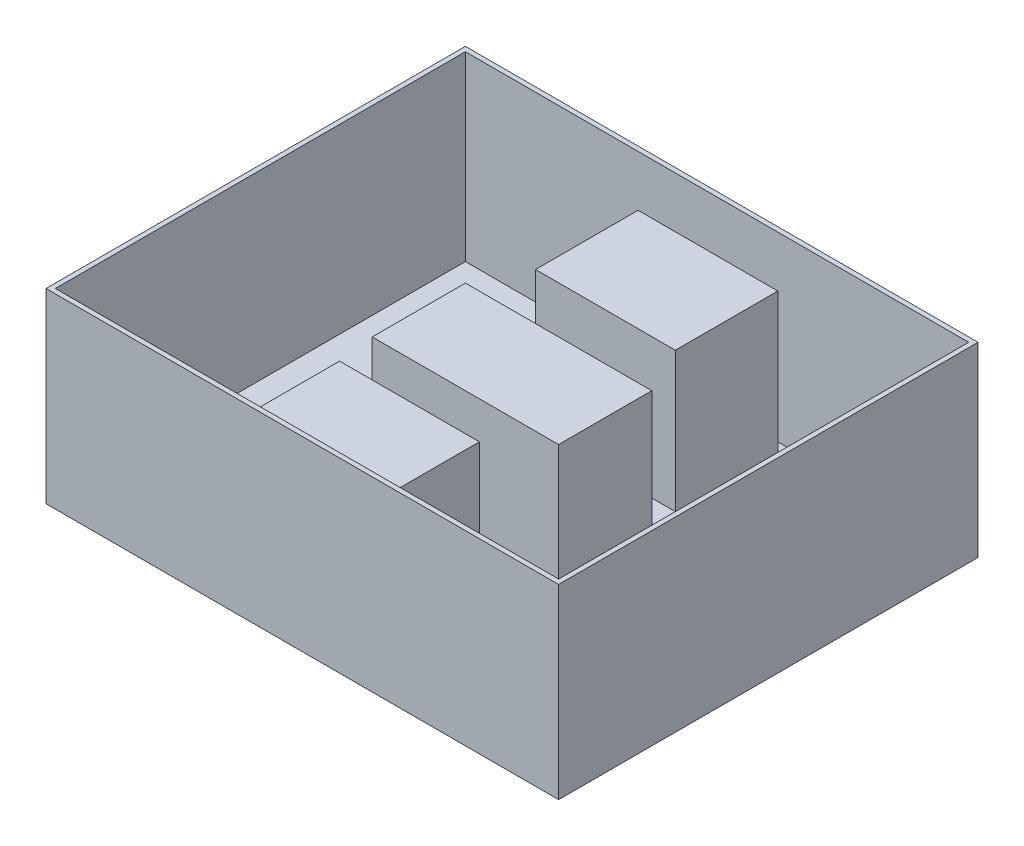
ISO-10303-21;
HEADER;
FILE_DESCRIPTION(('STEP AP214'),'2;1');
FILE_NAME('part.step','',(''),(''),'','','');
FILE_SCHEMA(('AUTOMOTIVE_DESIGN { 1 0 10303 214 1 1 1 1 }'));
ENDSEC;
DATA;
#1=APPLICATION_CONTEXT('core data for automotive mechanical design processes');
#2=APPLICATION_PROTOCOL_DEFINITION('international standard','automotive_design',2000,#1);
#3=PRODUCT_CONTEXT('',#1,'mechanical');
#4=PRODUCT('Part','Part','',(#3));
#5=PRODUCT_RELATED_PRODUCT_CATEGORY('part','',(#4));
#6=PRODUCT_DEFINITION_FORMATION('','',#4);
#7=PRODUCT_DEFINITION_CONTEXT('part definition',#1,'design');
#8=PRODUCT_DEFINITION('design','',#6,#7);
#9=PRODUCT_DEFINITION_SHAPE('','',#8);
#10=(LENGTH_UNIT() NAMED_UNIT(*) SI_UNIT(.MILLI.,.METRE.));
#11=(NAMED_UNIT(*) PLANE_ANGLE_UNIT() SI_UNIT($,.RADIAN.));
#12=(NAMED_UNIT(*) SI_UNIT($,.STERADIAN.) SOLID_ANGLE_UNIT());
#13=UNCERTAINTY_MEASURE_WITH_UNIT(LENGTH_MEASURE(1.E-05),#10,'distance_accuracy_value','');
#14=(GEOMETRIC_REPRESENTATION_CONTEXT(3) GLOBAL_UNCERTAINTY_ASSIGNED_CONTEXT((#13)) GLOBAL_UNIT_ASSIGNED_CONTEXT((#10,
#11,#12)) REPRESENTATION_CONTEXT('',''));
#15=CARTESIAN_POINT('',(0.,0.,0.));
#16=DIRECTION('',(0.,0.,1.));
#17=DIRECTION('',(1.,0.,0.));
#18=AXIS2_PLACEMENT_3D('',#15,#16,#17);
#19=CARTESIAN_POINT('',(0.,5.,0.));
#20=DIRECTION('',(0.,-1.,0.));
#21=DIRECTION('',(0.,0.,-1.));
#22=AXIS2_PLACEMENT_3D('',#19,#20,#21);
#23=PLANE('',#22);
#24=DIRECTION('',(0.,0.,1.));
#25=VECTOR('',#24,1.);
#26=CARTESIAN_POINT('',(75.,5.,-210.273399608635));
#27=LINE('',#26,#25);
#28=CARTESIAN_POINT('',(75.,5.,-210.273399608635));
#29=VERTEX_POINT('',#28);
#30=CARTESIAN_POINT('',(75.,5.,-100.273399608635));
#31=VERTEX_POINT('',#30);
#32=EDGE_CURVE('E197',#29,#31,#27,.T.);
#33=ORIENTED_EDGE('',*,*,#32,.T.);
#34=DIRECTION('',(-1.,0.,0.));
#35=VECTOR('',#34,1.);
#36=CARTESIAN_POINT('',(75.,5.,-100.273399608635));
#37=LINE('',#36,#35);
#38=CARTESIAN_POINT('',(-75.,5.,-100.273399608635));
#39=VERTEX_POINT('',#38);
#40=EDGE_CURVE('E204',#31,#39,#37,.T.);
#41=ORIENTED_EDGE('',*,*,#40,.T.);
#42=DIRECTION('',(0.,0.,-1.));
#43=VECTOR('',#42,1.);
#44=CARTESIAN_POINT('',(-75.,5.,-100.273399608635));
#45=LINE('',#44,#43);
#46=CARTESIAN_POINT('',(-75.,5.,-210.273399608635));
#47=VERTEX_POINT('',#46);
#48=EDGE_CURVE('E177',#39,#47,#45,.T.);
#49=ORIENTED_EDGE('',*,*,#48,.T.);
#50=DIRECTION('',(1.,0.,0.));
#51=VECTOR('',#50,1.);
#52=CARTESIAN_POINT('',(-75.,5.,-210.273399608635));
#53=LINE('',#52,#51);
#54=EDGE_CURVE('E50',#47,#29,#53,.T.);
#55=ORIENTED_EDGE('',*,*,#54,.T.);
#56=EDGE_LOOP('',(#33,#41,#49,#55));
#57=FACE_BOUND('',#56,.T.);
#58=DIRECTION('',(1.,0.,0.));
#59=VECTOR('',#58,1.);
#60=CARTESIAN_POINT('',(75.,5.,213.232553667431));
#61=LINE('',#60,#59);
#62=CARTESIAN_POINT('',(-75.,5.,213.232553667431));
#63=VERTEX_POINT('',#62);
#64=CARTESIAN_POINT('',(75.,5.,213.232553667431));
#65=VERTEX_POINT('',#64);
#66=EDGE_CURVE('E225',#63,#65,#61,.T.);
#67=ORIENTED_EDGE('',*,*,#66,.F.);
#68=DIRECTION('',(0.,0.,1.));
#69=VECTOR('',#68,1.);
#70=CARTESIAN_POINT('',(-75.,5.,213.232553667431));
#71=LINE('',#70,#69);
#72=CARTESIAN_POINT('',(-75.,5.,110.));
#73=VERTEX_POINT('',#72);
#74=EDGE_CURVE('E58',#73,#63,#71,.T.);
#75=ORIENTED_EDGE('',*,*,#74,.F.);
#76=DIRECTION('',(-1.,0.,0.));
#77=VECTOR('',#76,1.);
#78=CARTESIAN_POINT('',(75.,5.,110.));
#79=LINE('',#78,#77);
#80=CARTESIAN_POINT('',(75.,5.,110.));
#81=VERTEX_POINT('',#80);
#82=EDGE_CURVE('E231',#81,#73,#79,.T.);
#83=ORIENTED_EDGE('',*,*,#82,.F.);
#84=DIRECTION('',(0.,0.,-1.));
#85=VECTOR('',#84,1.);
#86=CARTESIAN_POINT('',(75.,5.,213.232553667431));
#87=LINE('',#86,#85);
#88=EDGE_CURVE('E228',#65,#81,#87,.T.);
#89=ORIENTED_EDGE('',*,*,#88,.F.);
#90=EDGE_LOOP('',(#67,#75,#83,#89));
#91=FACE_BOUND('',#90,.T.);
#92=DIRECTION('',(0.,0.,-1.));
#93=VECTOR('',#92,1.);
#94=CARTESIAN_POINT('',(270.,5.,0.));
#95=LINE('',#94,#93);
#96=CARTESIAN_POINT('',(270.,5.,220.));
#97=VERTEX_POINT('',#96);
#98=CARTESIAN_POINT('',(270.,5.,-220.));
#99=VERTEX_POINT('',#98);
#100=EDGE_CURVE('E323',#97,#99,#95,.T.);
#101=ORIENTED_EDGE('',*,*,#100,.T.);
#102=DIRECTION('',(-1.,0.,0.));
#103=VECTOR('',#102,1.);
#104=CARTESIAN_POINT('',(0.,5.,-220.));
#105=LINE('',#104,#103);
#106=CARTESIAN_POINT('',(-270.,5.,-220.));
#107=VERTEX_POINT('',#106);
#108=EDGE_CURVE('E326',#99,#107,#105,.T.);
#109=ORIENTED_EDGE('',*,*,#108,.T.);
#110=DIRECTION('',(0.,0.,1.));
#111=VECTOR('',#110,1.);
#112=CARTESIAN_POINT('',(-270.,5.,0.));
#113=LINE('',#112,#111);
#114=CARTESIAN_POINT('',(-270.,5.,220.));
#115=VERTEX_POINT('',#114);
#116=EDGE_CURVE('E338',#107,#115,#113,.T.);
#117=ORIENTED_EDGE('',*,*,#116,.T.);
#118=DIRECTION('',(1.,0.,0.));
#119=VECTOR('',#118,1.);
#120=CARTESIAN_POINT('',(0.,5.,220.));
#121=LINE('',#120,#119);
#122=EDGE_CURVE('E342',#115,#97,#121,.T.);
#123=ORIENTED_EDGE('',*,*,#122,.T.);
#124=EDGE_LOOP('',(#101,#109,#117,#123));
#125=FACE_BOUND('',#124,.T.);
#126=CARTESIAN_POINT('',(-175.,5.,-165.));
#127=DIRECTION('',(0.,1.,0.));
#128=DIRECTION('',(0.,0.,1.));
#129=AXIS2_PLACEMENT_3D('',#126,#127,#128);
#130=CIRCLE('',#129,5.00000000000002);
#131=CARTESIAN_POINT('',(-175.,5.,-160.));
#132=VERTEX_POINT('',#131);
#133=EDGE_CURVE('E317',#132,#132,#130,.T.);
#134=ORIENTED_EDGE('',*,*,#133,.F.);
#135=EDGE_LOOP('',(#134));
#136=FACE_BOUND('',#135,.T.);
#137=CARTESIAN_POINT('',(-175.,5.,-142.1));
#138=DIRECTION('',(0.,1.,0.));
#139=DIRECTION('',(0.,0.,1.));
#140=AXIS2_PLACEMENT_3D('',#137,#138,#139);
#141=CIRCLE('',#140,5.00000000000002);
#142=CARTESIAN_POINT('',(-175.,5.,-137.1));
#143=VERTEX_POINT('',#142);
#144=EDGE_CURVE('E311',#143,#143,#141,.T.);
#145=ORIENTED_EDGE('',*,*,#144,.F.);
#146=EDGE_LOOP('',(#145));
#147=FACE_BOUND('',#146,.T.);
#148=CARTESIAN_POINT('',(-175.,5.,165.));
#149=DIRECTION('',(0.,1.,0.));
#150=DIRECTION('',(0.,0.,1.));
#151=AXIS2_PLACEMENT_3D('',#148,#149,#150);
#152=CIRCLE('',#151,5.00000000000002);
#153=CARTESIAN_POINT('',(-175.,5.,170.));
#154=VERTEX_POINT('',#153);
#155=EDGE_CURVE('E305',#154,#154,#152,.T.);
#156=ORIENTED_EDGE('',*,*,#155,.F.);
#157=EDGE_LOOP('',(#156));
#158=FACE_BOUND('',#157,.T.);
#159=CARTESIAN_POINT('',(-175.,5.,142.1));
#160=DIRECTION('',(0.,1.,0.));
#161=DIRECTION('',(0.,0.,1.));
#162=AXIS2_PLACEMENT_3D('',#159,#160,#161);
#163=CIRCLE('',#162,5.00000000000002);
#164=CARTESIAN_POINT('',(-175.,5.,147.1));
#165=VERTEX_POINT('',#164);
#166=EDGE_CURVE('E299',#165,#165,#163,.T.);
#167=ORIENTED_EDGE('',*,*,#166,.F.);
#168=EDGE_LOOP('',(#167));
#169=FACE_BOUND('',#168,.T.);
#170=CARTESIAN_POINT('',(95.,5.,-165.));
#171=DIRECTION('',(0.,1.,0.));
#172=DIRECTION('',(0.,0.,1.));
#173=AXIS2_PLACEMENT_3D('',#170,#171,#172);
#174=CIRCLE('',#173,5.00000000000001);
#175=CARTESIAN_POINT('',(95.,5.,-160.));
#176=VERTEX_POINT('',#175);
#177=EDGE_CURVE('E293',#176,#176,#174,.T.);
#178=ORIENTED_EDGE('',*,*,#177,.F.);
#179=EDGE_LOOP('',(#178));
#180=FACE_BOUND('',#179,.T.);
#181=CARTESIAN_POINT('',(95.,5.,-142.1));
#182=DIRECTION('',(0.,1.,0.));
#183=DIRECTION('',(0.,0.,1.));
#184=AXIS2_PLACEMENT_3D('',#181,#182,#183);
#185=CIRCLE('',#184,5.00000000000001);
#186=CARTESIAN_POINT('',(95.,5.,-137.1));
#187=VERTEX_POINT('',#186);
#188=EDGE_CURVE('E287',#187,#187,#185,.T.);
#189=ORIENTED_EDGE('',*,*,#188,.F.);
#190=EDGE_LOOP('',(#189));
#191=FACE_BOUND('',#190,.T.);
#192=CARTESIAN_POINT('',(95.,5.,165.));
#193=DIRECTION('',(0.,1.,0.));
#194=DIRECTION('',(0.,0.,1.));
#195=AXIS2_PLACEMENT_3D('',#192,#193,#194);
#196=CIRCLE('',#195,5.00000000000001);
#197=CARTESIAN_POINT('',(95.,5.,170.));
#198=VERTEX_POINT('',#197);
#199=EDGE_CURVE('E281',#198,#198,#196,.T.);
#200=ORIENTED_EDGE('',*,*,#199,.F.);
#201=EDGE_LOOP('',(#200));
#202=FACE_BOUND('',#201,.T.);
#203=CARTESIAN_POINT('',(95.,5.,142.1));
#204=DIRECTION('',(0.,1.,0.));
#205=DIRECTION('',(0.,0.,1.));
#206=AXIS2_PLACEMENT_3D('',#203,#204,#205);
#207=CIRCLE('',#206,5.00000000000001);
#208=CARTESIAN_POINT('',(95.,5.,147.1));
#209=VERTEX_POINT('',#208);
#210=EDGE_CURVE('E275',#209,#209,#207,.T.);
#211=ORIENTED_EDGE('',*,*,#210,.F.);
#212=EDGE_LOOP('',(#211));
#213=FACE_BOUND('',#212,.T.);
#214=DIRECTION('',(-1.,0.,0.));
#215=VECTOR('',#214,1.);
#216=CARTESIAN_POINT('',(-100.,5.,-50.));
#217=LINE('',#216,#215);
#218=CARTESIAN_POINT('',(100.,5.,-50.));
#219=VERTEX_POINT('',#218);
#220=CARTESIAN_POINT('',(-100.,5.,-50.));
#221=VERTEX_POINT('',#220);
#222=EDGE_CURVE('E237',#219,#221,#217,.T.);
#223=ORIENTED_EDGE('',*,*,#222,.F.);
#224=DIRECTION('',(0.,0.,-1.));
#225=VECTOR('',#224,1.);
#226=CARTESIAN_POINT('',(100.,5.,50.));
#227=LINE('',#226,#225);
#228=CARTESIAN_POINT('',(100.,5.,50.));
#229=VERTEX_POINT('',#228);
#230=EDGE_CURVE('E247',#229,#219,#227,.T.);
#231=ORIENTED_EDGE('',*,*,#230,.F.);
#232=DIRECTION('',(1.,0.,0.));
#233=VECTOR('',#232,1.);
#234=CARTESIAN_POINT('',(-100.,5.,50.));
#235=LINE('',#234,#233);
#236=CARTESIAN_POINT('',(-100.,5.,50.));
#237=VERTEX_POINT('',#236);
#238=EDGE_CURVE('E259',#237,#229,#235,.T.);
#239=ORIENTED_EDGE('',*,*,#238,.F.);
#240=DIRECTION('',(0.,0.,1.));
#241=VECTOR('',#240,1.);
#242=CARTESIAN_POINT('',(-100.,5.,50.));
#243=LINE('',#242,#241);
#244=EDGE_CURVE('E256',#221,#237,#243,.T.);
#245=ORIENTED_EDGE('',*,*,#244,.F.);
#246=EDGE_LOOP('',(#223,#231,#239,#245));
#247=FACE_BOUND('',#246,.T.);
#248=ADVANCED_FACE('F35',(#57,#91,#125,#136,#147,#158,#169,#180,#191,#202,#213,#247),#23,.F.);
#249=CARTESIAN_POINT('',(0.,200.,0.));
#250=DIRECTION('',(0.,-1.,0.));
#251=DIRECTION('',(0.,0.,-1.));
#252=AXIS2_PLACEMENT_3D('',#249,#250,#251);
#253=PLANE('',#252);
#254=DIRECTION('',(0.,0.,-1.));
#255=VECTOR('',#254,1.);
#256=CARTESIAN_POINT('',(275.,200.,225.));
#257=LINE('',#256,#255);
#258=CARTESIAN_POINT('',(275.,200.,225.));
#259=VERTEX_POINT('',#258);
#260=CARTESIAN_POINT('',(275.,200.,-225.));
#261=VERTEX_POINT('',#260);
#262=EDGE_CURVE('E354',#259,#261,#257,.T.);
#263=ORIENTED_EDGE('',*,*,#262,.T.);
#264=DIRECTION('',(-1.,0.,0.));
#265=VECTOR('',#264,1.);
#266=CARTESIAN_POINT('',(-275.,200.,-225.));
#267=LINE('',#266,#265);
#268=CARTESIAN_POINT('',(-275.,200.,-225.));
#269=VERTEX_POINT('',#268);
#270=EDGE_CURVE('E357',#261,#269,#267,.T.);
#271=ORIENTED_EDGE('',*,*,#270,.T.);
#272=DIRECTION('',(0.,0.,1.));
#273=VECTOR('',#272,1.);
#274=CARTESIAN_POINT('',(-275.,200.,225.));
#275=LINE('',#274,#273);
#276=CARTESIAN_POINT('',(-275.,200.,225.));
#277=VERTEX_POINT('',#276);
#278=EDGE_CURVE('E360',#269,#277,#275,.T.);
#279=ORIENTED_EDGE('',*,*,#278,.T.);
#280=DIRECTION('',(1.,0.,0.));
#281=VECTOR('',#280,1.);
#282=CARTESIAN_POINT('',(-275.,200.,225.));
#283=LINE('',#282,#281);
#284=EDGE_CURVE('E362',#277,#259,#283,.T.);
#285=ORIENTED_EDGE('',*,*,#284,.T.);
#286=EDGE_LOOP('',(#263,#271,#279,#285));
#287=FACE_BOUND('',#286,.T.);
#288=DIRECTION('',(0.,0.,-1.));
#289=VECTOR('',#288,1.);
#290=CARTESIAN_POINT('',(270.,200.,0.));
#291=LINE('',#290,#289);
#292=CARTESIAN_POINT('',(270.,200.,220.));
#293=VERTEX_POINT('',#292);
#294=CARTESIAN_POINT('',(270.,200.,-220.));
#295=VERTEX_POINT('',#294);
#296=EDGE_CURVE('E346',#293,#295,#291,.T.);
#297=ORIENTED_EDGE('',*,*,#296,.F.);
#298=DIRECTION('',(1.,0.,0.));
#299=VECTOR('',#298,1.);
#300=CARTESIAN_POINT('',(0.,200.,220.));
#301=LINE('',#300,#299);
#302=CARTESIAN_POINT('',(-270.,200.,220.));
#303=VERTEX_POINT('',#302);
#304=EDGE_CURVE('E336',#303,#293,#301,.T.);
#305=ORIENTED_EDGE('',*,*,#304,.F.);
#306=DIRECTION('',(0.,0.,1.));
#307=VECTOR('',#306,1.);
#308=CARTESIAN_POINT('',(-270.,200.,0.));
#309=LINE('',#308,#307);
#310=CARTESIAN_POINT('',(-270.,200.,-220.));
#311=VERTEX_POINT('',#310);
#312=EDGE_CURVE('E350',#311,#303,#309,.T.);
#313=ORIENTED_EDGE('',*,*,#312,.F.);
#314=DIRECTION('',(-1.,0.,0.));
#315=VECTOR('',#314,1.);
#316=CARTESIAN_POINT('',(0.,200.,-220.));
#317=LINE('',#316,#315);
#318=EDGE_CURVE('E348',#295,#311,#317,.T.);
#319=ORIENTED_EDGE('',*,*,#318,.F.);
#320=EDGE_LOOP('',(#297,#305,#313,#319));
#321=FACE_BOUND('',#320,.T.);
#322=ADVANCED_FACE('F396',(#287,#321),#253,.F.);
#323=CARTESIAN_POINT('',(275.,200.,225.));
#324=DIRECTION('',(-1.,0.,0.));
#325=DIRECTION('',(0.,0.,1.));
#326=AXIS2_PLACEMENT_3D('',#323,#324,#325);
#327=PLANE('',#326);
#328=DIRECTION('',(0.,0.,-1.));
#329=VECTOR('',#328,1.);
#330=CARTESIAN_POINT('',(275.,0.,225.));
#331=LINE('',#330,#329);
#332=CARTESIAN_POINT('',(275.,0.,225.));
#333=VERTEX_POINT('',#332);
#334=CARTESIAN_POINT('',(275.,0.,-225.));
#335=VERTEX_POINT('',#334);
#336=EDGE_CURVE('E330',#333,#335,#331,.T.);
#337=ORIENTED_EDGE('',*,*,#336,.T.);
#338=DIRECTION('',(0.,-1.,0.));
#339=VECTOR('',#338,1.);
#340=CARTESIAN_POINT('',(275.,200.,-225.));
#341=LINE('',#340,#339);
#342=EDGE_CURVE('E11',#261,#335,#341,.T.);
#343=ORIENTED_EDGE('',*,*,#342,.F.);
#344=ORIENTED_EDGE('',*,*,#262,.F.);
#345=DIRECTION('',(0.,-1.,0.));
#346=VECTOR('',#345,1.);
#347=CARTESIAN_POINT('',(275.,200.,225.));
#348=LINE('',#347,#346);
#349=EDGE_CURVE('E364',#259,#333,#348,.T.);
#350=ORIENTED_EDGE('',*,*,#349,.T.);
#351=EDGE_LOOP('',(#337,#343,#344,#350));
#352=FACE_BOUND('',#351,.T.);
#353=ADVANCED_FACE('F37',(#352),#327,.F.);
#354=CARTESIAN_POINT('',(-275.,200.,-225.));
#355=DIRECTION('',(0.,0.,1.));
#356=DIRECTION('',(1.,0.,0.));
#357=AXIS2_PLACEMENT_3D('',#354,#355,#356);
#358=PLANE('',#357);
#359=DIRECTION('',(-1.,0.,0.));
#360=VECTOR('',#359,1.);
#361=CARTESIAN_POINT('',(-275.,0.,-225.));
#362=LINE('',#361,#360);
#363=CARTESIAN_POINT('',(-275.,0.,-225.));
#364=VERTEX_POINT('',#363);
#365=EDGE_CURVE('E367',#335,#364,#362,.T.);
#366=ORIENTED_EDGE('',*,*,#365,.T.);
#367=DIRECTION('',(0.,-1.,0.));
#368=VECTOR('',#367,1.);
#369=CARTESIAN_POINT('',(-275.,200.,-225.));
#370=LINE('',#369,#368);
#371=EDGE_CURVE('E43',#269,#364,#370,.T.);
#372=ORIENTED_EDGE('',*,*,#371,.F.);
#373=ORIENTED_EDGE('',*,*,#270,.F.);
#374=ORIENTED_EDGE('',*,*,#342,.T.);
#375=EDGE_LOOP('',(#366,#372,#373,#374));
#376=FACE_BOUND('',#375,.T.);
#377=ADVANCED_FACE('F398',(#376),#358,.F.);
#378=CARTESIAN_POINT('',(-275.,200.,225.));
#379=DIRECTION('',(1.,0.,0.));
#380=DIRECTION('',(0.,0.,-1.));
#381=AXIS2_PLACEMENT_3D('',#378,#379,#380);
#382=PLANE('',#381);
#383=DIRECTION('',(0.,0.,1.));
#384=VECTOR('',#383,1.);
#385=CARTESIAN_POINT('',(-275.,0.,225.));
#386=LINE('',#385,#384);
#387=CARTESIAN_POINT('',(-275.,0.,225.));
#388=VERTEX_POINT('',#387);
#389=EDGE_CURVE('E369',#364,#388,#386,.T.);
#390=ORIENTED_EDGE('',*,*,#389,.T.);
#391=DIRECTION('',(0.,-1.,0.));
#392=VECTOR('',#391,1.);
#393=CARTESIAN_POINT('',(-275.,200.,225.));
#394=LINE('',#393,#392);
#395=EDGE_CURVE('E374',#277,#388,#394,.T.);
#396=ORIENTED_EDGE('',*,*,#395,.F.);
#397=ORIENTED_EDGE('',*,*,#278,.F.);
#398=ORIENTED_EDGE('',*,*,#371,.T.);
#399=EDGE_LOOP('',(#390,#396,#397,#398));
#400=FACE_BOUND('',#399,.T.);
#401=ADVANCED_FACE('F381',(#400),#382,.F.);
#402=CARTESIAN_POINT('',(-275.,200.,225.));
#403=DIRECTION('',(0.,0.,-1.));
#404=DIRECTION('',(-1.,0.,0.));
#405=AXIS2_PLACEMENT_3D('',#402,#403,#404);
#406=PLANE('',#405);
#407=DIRECTION('',(1.,0.,0.));
#408=VECTOR('',#407,1.);
#409=CARTESIAN_POINT('',(-275.,0.,225.));
#410=LINE('',#409,#408);
#411=EDGE_CURVE('E358',#388,#333,#410,.T.);
#412=ORIENTED_EDGE('',*,*,#411,.T.);
#413=ORIENTED_EDGE('',*,*,#349,.F.);
#414=ORIENTED_EDGE('',*,*,#284,.F.);
#415=ORIENTED_EDGE('',*,*,#395,.T.);
#416=EDGE_LOOP('',(#412,#413,#414,#415));
#417=FACE_BOUND('',#416,.T.);
#418=ADVANCED_FACE('F390',(#417),#406,.F.);
#419=CARTESIAN_POINT('',(0.,0.,0.));
#420=DIRECTION('',(0.,-1.,0.));
#421=DIRECTION('',(0.,0.,-1.));
#422=AXIS2_PLACEMENT_3D('',#419,#420,#421);
#423=PLANE('',#422);
#424=CARTESIAN_POINT('',(95.,0.,142.1));
#425=DIRECTION('',(0.,-1.,0.));
#426=DIRECTION('',(0.,0.,-1.));
#427=AXIS2_PLACEMENT_3D('',#424,#425,#426);
#428=CIRCLE('',#427,5.00000000000001);
#429=CARTESIAN_POINT('',(95.,0.,137.1));
#430=VERTEX_POINT('',#429);
#431=EDGE_CURVE('E278',#430,#430,#428,.T.);
#432=ORIENTED_EDGE('',*,*,#431,.F.);
#433=EDGE_LOOP('',(#432));
#434=FACE_BOUND('',#433,.T.);
#435=CARTESIAN_POINT('',(95.,0.,165.));
#436=DIRECTION('',(0.,-1.,0.));
#437=DIRECTION('',(0.,0.,-1.));
#438=AXIS2_PLACEMENT_3D('',#435,#436,#437);
#439=CIRCLE('',#438,5.00000000000001);
#440=CARTESIAN_POINT('',(95.,0.,160.));
#441=VERTEX_POINT('',#440);
#442=EDGE_CURVE('E284',#441,#441,#439,.T.);
#443=ORIENTED_EDGE('',*,*,#442,.F.);
#444=EDGE_LOOP('',(#443));
#445=FACE_BOUND('',#444,.T.);
#446=CARTESIAN_POINT('',(95.,0.,-142.1));
#447=DIRECTION('',(0.,-1.,0.));
#448=DIRECTION('',(0.,0.,-1.));
#449=AXIS2_PLACEMENT_3D('',#446,#447,#448);
#450=CIRCLE('',#449,5.00000000000001);
#451=CARTESIAN_POINT('',(95.,0.,-147.1));
#452=VERTEX_POINT('',#451);
#453=EDGE_CURVE('E290',#452,#452,#450,.T.);
#454=ORIENTED_EDGE('',*,*,#453,.F.);
#455=EDGE_LOOP('',(#454));
#456=FACE_BOUND('',#455,.T.);
#457=CARTESIAN_POINT('',(95.,0.,-165.));
#458=DIRECTION('',(0.,-1.,0.));
#459=DIRECTION('',(0.,0.,-1.));
#460=AXIS2_PLACEMENT_3D('',#457,#458,#459);
#461=CIRCLE('',#460,5.00000000000001);
#462=CARTESIAN_POINT('',(95.,0.,-170.));
#463=VERTEX_POINT('',#462);
#464=EDGE_CURVE('E296',#463,#463,#461,.T.);
#465=ORIENTED_EDGE('',*,*,#464,.F.);
#466=EDGE_LOOP('',(#465));
#467=FACE_BOUND('',#466,.T.);
#468=CARTESIAN_POINT('',(-175.,0.,142.1));
#469=DIRECTION('',(0.,-1.,0.));
#470=DIRECTION('',(0.,0.,-1.));
#471=AXIS2_PLACEMENT_3D('',#468,#469,#470);
#472=CIRCLE('',#471,5.00000000000002);
#473=CARTESIAN_POINT('',(-175.,0.,137.1));
#474=VERTEX_POINT('',#473);
#475=EDGE_CURVE('E302',#474,#474,#472,.T.);
#476=ORIENTED_EDGE('',*,*,#475,.F.);
#477=EDGE_LOOP('',(#476));
#478=FACE_BOUND('',#477,.T.);
#479=CARTESIAN_POINT('',(-175.,0.,165.));
#480=DIRECTION('',(0.,-1.,0.));
#481=DIRECTION('',(0.,0.,-1.));
#482=AXIS2_PLACEMENT_3D('',#479,#480,#481);
#483=CIRCLE('',#482,5.00000000000002);
#484=CARTESIAN_POINT('',(-175.,0.,160.));
#485=VERTEX_POINT('',#484);
#486=EDGE_CURVE('E308',#485,#485,#483,.T.);
#487=ORIENTED_EDGE('',*,*,#486,.F.);
#488=EDGE_LOOP('',(#487));
#489=FACE_BOUND('',#488,.T.);
#490=CARTESIAN_POINT('',(-175.,0.,-142.1));
#491=DIRECTION('',(0.,-1.,0.));
#492=DIRECTION('',(0.,0.,-1.));
#493=AXIS2_PLACEMENT_3D('',#490,#491,#492);
#494=CIRCLE('',#493,5.00000000000002);
#495=CARTESIAN_POINT('',(-175.,0.,-147.1));
#496=VERTEX_POINT('',#495);
#497=EDGE_CURVE('E314',#496,#496,#494,.T.);
#498=ORIENTED_EDGE('',*,*,#497,.F.);
#499=EDGE_LOOP('',(#498));
#500=FACE_BOUND('',#499,.T.);
#501=CARTESIAN_POINT('',(-175.,0.,-165.));
#502=DIRECTION('',(0.,-1.,0.));
#503=DIRECTION('',(0.,0.,-1.));
#504=AXIS2_PLACEMENT_3D('',#501,#502,#503);
#505=CIRCLE('',#504,5.00000000000002);
#506=CARTESIAN_POINT('',(-175.,0.,-170.));
#507=VERTEX_POINT('',#506);
#508=EDGE_CURVE('E320',#507,#507,#505,.T.);
#509=ORIENTED_EDGE('',*,*,#508,.F.);
#510=EDGE_LOOP('',(#509));
#511=FACE_BOUND('',#510,.T.);
#512=ORIENTED_EDGE('',*,*,#336,.F.);
#513=ORIENTED_EDGE('',*,*,#411,.F.);
#514=ORIENTED_EDGE('',*,*,#389,.F.);
#515=ORIENTED_EDGE('',*,*,#365,.F.);
#516=EDGE_LOOP('',(#512,#513,#514,#515));
#517=FACE_BOUND('',#516,.T.);
#518=ADVANCED_FACE('F387',(#434,#445,#456,#467,#478,#489,#500,#511,#517),#423,.T.);
#519=CARTESIAN_POINT('',(270.,200.,225.));
#520=DIRECTION('',(-1.,0.,0.));
#521=DIRECTION('',(0.,0.,1.));
#522=AXIS2_PLACEMENT_3D('',#519,#520,#521);
#523=PLANE('',#522);
#524=ORIENTED_EDGE('',*,*,#100,.F.);
#525=DIRECTION('',(0.,-1.,0.));
#526=VECTOR('',#525,1.);
#527=CARTESIAN_POINT('',(270.,200.,220.));
#528=LINE('',#527,#526);
#529=EDGE_CURVE('E332',#293,#97,#528,.T.);
#530=ORIENTED_EDGE('',*,*,#529,.F.);
#531=ORIENTED_EDGE('',*,*,#296,.T.);
#532=DIRECTION('',(0.,-1.,0.));
#533=VECTOR('',#532,1.);
#534=CARTESIAN_POINT('',(270.,200.,-220.));
#535=LINE('',#534,#533);
#536=EDGE_CURVE('E327',#295,#99,#535,.T.);
#537=ORIENTED_EDGE('',*,*,#536,.T.);
#538=EDGE_LOOP('',(#524,#530,#531,#537));
#539=FACE_BOUND('',#538,.T.);
#540=ADVANCED_FACE('F421',(#539),#523,.T.);
#541=CARTESIAN_POINT('',(-275.,200.,-220.));
#542=DIRECTION('',(0.,0.,1.));
#543=DIRECTION('',(1.,0.,0.));
#544=AXIS2_PLACEMENT_3D('',#541,#542,#543);
#545=PLANE('',#544);
#546=ORIENTED_EDGE('',*,*,#108,.F.);
#547=ORIENTED_EDGE('',*,*,#536,.F.);
#548=ORIENTED_EDGE('',*,*,#318,.T.);
#549=DIRECTION('',(0.,-1.,0.));
#550=VECTOR('',#549,1.);
#551=CARTESIAN_POINT('',(-270.,200.,-220.));
#552=LINE('',#551,#550);
#553=EDGE_CURVE('E331',#311,#107,#552,.T.);
#554=ORIENTED_EDGE('',*,*,#553,.T.);
#555=EDGE_LOOP('',(#546,#547,#548,#554));
#556=FACE_BOUND('',#555,.T.);
#557=ADVANCED_FACE('F441',(#556),#545,.T.);
#558=CARTESIAN_POINT('',(-270.,200.,225.));
#559=DIRECTION('',(1.,0.,0.));
#560=DIRECTION('',(0.,0.,-1.));
#561=AXIS2_PLACEMENT_3D('',#558,#559,#560);
#562=PLANE('',#561);
#563=ORIENTED_EDGE('',*,*,#116,.F.);
#564=ORIENTED_EDGE('',*,*,#553,.F.);
#565=ORIENTED_EDGE('',*,*,#312,.T.);
#566=DIRECTION('',(0.,-1.,0.));
#567=VECTOR('',#566,1.);
#568=CARTESIAN_POINT('',(-270.,200.,220.));
#569=LINE('',#568,#567);
#570=EDGE_CURVE('E335',#303,#115,#569,.T.);
#571=ORIENTED_EDGE('',*,*,#570,.T.);
#572=EDGE_LOOP('',(#563,#564,#565,#571));
#573=FACE_BOUND('',#572,.T.);
#574=ADVANCED_FACE('F449',(#573),#562,.T.);
#575=CARTESIAN_POINT('',(-275.,200.,220.));
#576=DIRECTION('',(0.,0.,-1.));
#577=DIRECTION('',(-1.,0.,0.));
#578=AXIS2_PLACEMENT_3D('',#575,#576,#577);
#579=PLANE('',#578);
#580=ORIENTED_EDGE('',*,*,#122,.F.);
#581=ORIENTED_EDGE('',*,*,#570,.F.);
#582=ORIENTED_EDGE('',*,*,#304,.T.);
#583=ORIENTED_EDGE('',*,*,#529,.T.);
#584=EDGE_LOOP('',(#580,#581,#582,#583));
#585=FACE_BOUND('',#584,.T.);
#586=ADVANCED_FACE('F416',(#585),#579,.T.);
#587=CARTESIAN_POINT('',(-175.,-45.,-165.));
#588=DIRECTION('',(0.,1.,0.));
#589=DIRECTION('',(0.,0.,1.));
#590=AXIS2_PLACEMENT_3D('',#587,#588,#589);
#591=CYLINDRICAL_SURFACE('',#590,5.00000000000002);
#592=ORIENTED_EDGE('',*,*,#508,.T.);
#593=EDGE_LOOP('',(#592));
#594=FACE_BOUND('',#593,.T.);
#595=ORIENTED_EDGE('',*,*,#133,.T.);
#596=EDGE_LOOP('',(#595));
#597=FACE_BOUND('',#596,.T.);
#598=ADVANCED_FACE('F463',(#594,#597),#591,.F.);
#599=CARTESIAN_POINT('',(-175.,-45.,-142.1));
#600=DIRECTION('',(0.,1.,0.));
#601=DIRECTION('',(0.,0.,1.));
#602=AXIS2_PLACEMENT_3D('',#599,#600,#601);
#603=CYLINDRICAL_SURFACE('',#602,5.00000000000002);
#604=ORIENTED_EDGE('',*,*,#497,.T.);
#605=EDGE_LOOP('',(#604));
#606=FACE_BOUND('',#605,.T.);
#607=ORIENTED_EDGE('',*,*,#144,.T.);
#608=EDGE_LOOP('',(#607));
#609=FACE_BOUND('',#608,.T.);
#610=ADVANCED_FACE('F470',(#606,#609),#603,.F.);
#611=CARTESIAN_POINT('',(-175.,-45.,165.));
#612=DIRECTION('',(0.,1.,0.));
#613=DIRECTION('',(0.,0.,1.));
#614=AXIS2_PLACEMENT_3D('',#611,#612,#613);
#615=CYLINDRICAL_SURFACE('',#614,5.00000000000002);
#616=ORIENTED_EDGE('',*,*,#486,.T.);
#617=EDGE_LOOP('',(#616));
#618=FACE_BOUND('',#617,.T.);
#619=ORIENTED_EDGE('',*,*,#155,.T.);
#620=EDGE_LOOP('',(#619));
#621=FACE_BOUND('',#620,.T.);
#622=ADVANCED_FACE('F478',(#618,#621),#615,.F.);
#623=CARTESIAN_POINT('',(-175.,-45.,142.1));
#624=DIRECTION('',(0.,1.,0.));
#625=DIRECTION('',(0.,0.,1.));
#626=AXIS2_PLACEMENT_3D('',#623,#624,#625);
#627=CYLINDRICAL_SURFACE('',#626,5.00000000000002);
#628=ORIENTED_EDGE('',*,*,#475,.T.);
#629=EDGE_LOOP('',(#628));
#630=FACE_BOUND('',#629,.T.);
#631=ORIENTED_EDGE('',*,*,#166,.T.);
#632=EDGE_LOOP('',(#631));
#633=FACE_BOUND('',#632,.T.);
#634=ADVANCED_FACE('F486',(#630,#633),#627,.F.);
#635=CARTESIAN_POINT('',(95.,-45.,-165.));
#636=DIRECTION('',(0.,1.,0.));
#637=DIRECTION('',(0.,0.,1.));
#638=AXIS2_PLACEMENT_3D('',#635,#636,#637);
#639=CYLINDRICAL_SURFACE('',#638,5.00000000000001);
#640=ORIENTED_EDGE('',*,*,#464,.T.);
#641=EDGE_LOOP('',(#640));
#642=FACE_BOUND('',#641,.T.);
#643=ORIENTED_EDGE('',*,*,#177,.T.);
#644=EDGE_LOOP('',(#643));
#645=FACE_BOUND('',#644,.T.);
#646=ADVANCED_FACE('F494',(#642,#645),#639,.F.);
#647=CARTESIAN_POINT('',(95.,-45.,-142.1));
#648=DIRECTION('',(0.,1.,0.));
#649=DIRECTION('',(0.,0.,1.));
#650=AXIS2_PLACEMENT_3D('',#647,#648,#649);
#651=CYLINDRICAL_SURFACE('',#650,5.00000000000001);
#652=ORIENTED_EDGE('',*,*,#453,.T.);
#653=EDGE_LOOP('',(#652));
#654=FACE_BOUND('',#653,.T.);
#655=ORIENTED_EDGE('',*,*,#188,.T.);
#656=EDGE_LOOP('',(#655));
#657=FACE_BOUND('',#656,.T.);
#658=ADVANCED_FACE('F502',(#654,#657),#651,.F.);
#659=CARTESIAN_POINT('',(95.,-45.,165.));
#660=DIRECTION('',(0.,1.,0.));
#661=DIRECTION('',(0.,0.,1.));
#662=AXIS2_PLACEMENT_3D('',#659,#660,#661);
#663=CYLINDRICAL_SURFACE('',#662,5.00000000000001);
#664=ORIENTED_EDGE('',*,*,#442,.T.);
#665=EDGE_LOOP('',(#664));
#666=FACE_BOUND('',#665,.T.);
#667=ORIENTED_EDGE('',*,*,#199,.T.);
#668=EDGE_LOOP('',(#667));
#669=FACE_BOUND('',#668,.T.);
#670=ADVANCED_FACE('F510',(#666,#669),#663,.F.);
#671=CARTESIAN_POINT('',(95.,-45.,142.1));
#672=DIRECTION('',(0.,1.,0.));
#673=DIRECTION('',(0.,0.,1.));
#674=AXIS2_PLACEMENT_3D('',#671,#672,#673);
#675=CYLINDRICAL_SURFACE('',#674,5.00000000000001);
#676=ORIENTED_EDGE('',*,*,#431,.T.);
#677=EDGE_LOOP('',(#676));
#678=FACE_BOUND('',#677,.T.);
#679=ORIENTED_EDGE('',*,*,#210,.T.);
#680=EDGE_LOOP('',(#679));
#681=FACE_BOUND('',#680,.T.);
#682=ADVANCED_FACE('F517',(#678,#681),#675,.F.);
#683=CARTESIAN_POINT('',(-100.,155.,-50.));
#684=DIRECTION('',(0.,0.,1.));
#685=DIRECTION('',(1.,0.,0.));
#686=AXIS2_PLACEMENT_3D('',#683,#684,#685);
#687=PLANE('',#686);
#688=ORIENTED_EDGE('',*,*,#222,.T.);
#689=DIRECTION('',(0.,-1.,0.));
#690=VECTOR('',#689,1.);
#691=CARTESIAN_POINT('',(-100.,155.,-50.));
#692=LINE('',#691,#690);
#693=CARTESIAN_POINT('',(-100.,155.,-50.));
#694=VERTEX_POINT('',#693);
#695=EDGE_CURVE('E272',#694,#221,#692,.T.);
#696=ORIENTED_EDGE('',*,*,#695,.F.);
#697=DIRECTION('',(-1.,0.,0.));
#698=VECTOR('',#697,1.);
#699=CARTESIAN_POINT('',(-100.,155.,-50.));
#700=LINE('',#699,#698);
#701=CARTESIAN_POINT('',(100.,155.,-50.));
#702=VERTEX_POINT('',#701);
#703=EDGE_CURVE('E243',#702,#694,#700,.T.);
#704=ORIENTED_EDGE('',*,*,#703,.F.);
#705=DIRECTION('',(0.,-1.,0.));
#706=VECTOR('',#705,1.);
#707=CARTESIAN_POINT('',(100.,155.,-50.));
#708=LINE('',#707,#706);
#709=EDGE_CURVE('E253',#702,#219,#708,.T.);
#710=ORIENTED_EDGE('',*,*,#709,.T.);
#711=EDGE_LOOP('',(#688,#696,#704,#710));
#712=FACE_BOUND('',#711,.T.);
#713=ADVANCED_FACE('F524',(#712),#687,.F.);
#714=CARTESIAN_POINT('',(-100.,155.,50.));
#715=DIRECTION('',(1.,0.,0.));
#716=DIRECTION('',(0.,0.,-1.));
#717=AXIS2_PLACEMENT_3D('',#714,#715,#716);
#718=PLANE('',#717);
#719=ORIENTED_EDGE('',*,*,#244,.T.);
#720=DIRECTION('',(0.,-1.,0.));
#721=VECTOR('',#720,1.);
#722=CARTESIAN_POINT('',(-100.,155.,50.));
#723=LINE('',#722,#721);
#724=CARTESIAN_POINT('',(-100.,155.,50.));
#725=VERTEX_POINT('',#724);
#726=EDGE_CURVE('E269',#725,#237,#723,.T.);
#727=ORIENTED_EDGE('',*,*,#726,.F.);
#728=DIRECTION('',(0.,0.,1.));
#729=VECTOR('',#728,1.);
#730=CARTESIAN_POINT('',(-100.,155.,50.));
#731=LINE('',#730,#729);
#732=EDGE_CURVE('E246',#694,#725,#731,.T.);
#733=ORIENTED_EDGE('',*,*,#732,.F.);
#734=ORIENTED_EDGE('',*,*,#695,.T.);
#735=EDGE_LOOP('',(#719,#727,#733,#734));
#736=FACE_BOUND('',#735,.T.);
#737=ADVANCED_FACE('F537',(#736),#718,.F.);
#738=CARTESIAN_POINT('',(-100.,155.,50.));
#739=DIRECTION('',(0.,0.,-1.));
#740=DIRECTION('',(-1.,0.,0.));
#741=AXIS2_PLACEMENT_3D('',#738,#739,#740);
#742=PLANE('',#741);
#743=ORIENTED_EDGE('',*,*,#238,.T.);
#744=DIRECTION('',(0.,-1.,0.));
#745=VECTOR('',#744,1.);
#746=CARTESIAN_POINT('',(100.,155.,50.));
#747=LINE('',#746,#745);
#748=CARTESIAN_POINT('',(100.,155.,50.));
#749=VERTEX_POINT('',#748);
#750=EDGE_CURVE('E266',#749,#229,#747,.T.);
#751=ORIENTED_EDGE('',*,*,#750,.F.);
#752=DIRECTION('',(1.,0.,0.));
#753=VECTOR('',#752,1.);
#754=CARTESIAN_POINT('',(-100.,155.,50.));
#755=LINE('',#754,#753);
#756=EDGE_CURVE('E249',#725,#749,#755,.T.);
#757=ORIENTED_EDGE('',*,*,#756,.F.);
#758=ORIENTED_EDGE('',*,*,#726,.T.);
#759=EDGE_LOOP('',(#743,#751,#757,#758));
#760=FACE_BOUND('',#759,.T.);
#761=ADVANCED_FACE('F544',(#760),#742,.F.);
#762=CARTESIAN_POINT('',(100.,155.,50.));
#763=DIRECTION('',(-1.,0.,0.));
#764=DIRECTION('',(0.,0.,1.));
#765=AXIS2_PLACEMENT_3D('',#762,#763,#764);
#766=PLANE('',#765);
#767=ORIENTED_EDGE('',*,*,#230,.T.);
#768=ORIENTED_EDGE('',*,*,#709,.F.);
#769=DIRECTION('',(0.,0.,-1.));
#770=VECTOR('',#769,1.);
#771=CARTESIAN_POINT('',(100.,155.,50.));
#772=LINE('',#771,#770);
#773=EDGE_CURVE('E251',#749,#702,#772,.T.);
#774=ORIENTED_EDGE('',*,*,#773,.F.);
#775=ORIENTED_EDGE('',*,*,#750,.T.);
#776=EDGE_LOOP('',(#767,#768,#774,#775));
#777=FACE_BOUND('',#776,.T.);
#778=ADVANCED_FACE('F552',(#777),#766,.F.);
#779=CARTESIAN_POINT('',(0.,155.,0.));
#780=DIRECTION('',(0.,1.,0.));
#781=DIRECTION('',(0.,0.,1.));
#782=AXIS2_PLACEMENT_3D('',#779,#780,#781);
#783=PLANE('',#782);
#784=ORIENTED_EDGE('',*,*,#703,.T.);
#785=ORIENTED_EDGE('',*,*,#732,.T.);
#786=ORIENTED_EDGE('',*,*,#756,.T.);
#787=ORIENTED_EDGE('',*,*,#773,.T.);
#788=EDGE_LOOP('',(#784,#785,#786,#787));
#789=FACE_BOUND('',#788,.T.);
#790=ADVANCED_FACE('F560',(#789),#783,.T.);
#791=CARTESIAN_POINT('',(-75.,5.,213.232553667431));
#792=DIRECTION('',(-1.,0.,0.));
#793=DIRECTION('',(0.,0.,1.));
#794=AXIS2_PLACEMENT_3D('',#791,#792,#793);
#795=PLANE('',#794);
#796=DIRECTION('',(0.,1.,0.));
#797=VECTOR('',#796,1.);
#798=CARTESIAN_POINT('',(-75.,5.,213.232553667431));
#799=LINE('',#798,#797);
#800=CARTESIAN_POINT('',(-75.,175.,213.232553667431));
#801=VERTEX_POINT('',#800);
#802=EDGE_CURVE('E234',#63,#801,#799,.T.);
#803=ORIENTED_EDGE('',*,*,#802,.T.);
#804=DIRECTION('',(0.,0.,1.));
#805=VECTOR('',#804,1.);
#806=CARTESIAN_POINT('',(-75.,175.,213.232553667431));
#807=LINE('',#806,#805);
#808=CARTESIAN_POINT('',(-75.,175.,110.));
#809=VERTEX_POINT('',#808);
#810=EDGE_CURVE('E209',#809,#801,#807,.T.);
#811=ORIENTED_EDGE('',*,*,#810,.F.);
#812=DIRECTION('',(0.,1.,0.));
#813=VECTOR('',#812,1.);
#814=CARTESIAN_POINT('',(-75.,5.,110.));
#815=LINE('',#814,#813);
#816=EDGE_CURVE('E235',#73,#809,#815,.T.);
#817=ORIENTED_EDGE('',*,*,#816,.F.);
#818=ORIENTED_EDGE('',*,*,#74,.T.);
#819=EDGE_LOOP('',(#803,#811,#817,#818));
#820=FACE_BOUND('',#819,.T.);
#821=ADVANCED_FACE('F568',(#820),#795,.T.);
#822=CARTESIAN_POINT('',(75.,5.,110.));
#823=DIRECTION('',(0.,0.,-1.));
#824=DIRECTION('',(-1.,0.,0.));
#825=AXIS2_PLACEMENT_3D('',#822,#823,#824);
#826=PLANE('',#825);
#827=ORIENTED_EDGE('',*,*,#816,.T.);
#828=DIRECTION('',(-1.,0.,0.));
#829=VECTOR('',#828,1.);
#830=CARTESIAN_POINT('',(75.,175.,110.));
#831=LINE('',#830,#829);
#832=CARTESIAN_POINT('',(75.,175.,110.));
#833=VERTEX_POINT('',#832);
#834=EDGE_CURVE('E221',#833,#809,#831,.T.);
#835=ORIENTED_EDGE('',*,*,#834,.F.);
#836=DIRECTION('',(0.,1.,0.));
#837=VECTOR('',#836,1.);
#838=CARTESIAN_POINT('',(75.,5.,110.));
#839=LINE('',#838,#837);
#840=EDGE_CURVE('E238',#81,#833,#839,.T.);
#841=ORIENTED_EDGE('',*,*,#840,.F.);
#842=ORIENTED_EDGE('',*,*,#82,.T.);
#843=EDGE_LOOP('',(#827,#835,#841,#842));
#844=FACE_BOUND('',#843,.T.);
#845=ADVANCED_FACE('F576',(#844),#826,.T.);
#846=CARTESIAN_POINT('',(75.,5.,213.232553667431));
#847=DIRECTION('',(1.,0.,0.));
#848=DIRECTION('',(0.,0.,-1.));
#849=AXIS2_PLACEMENT_3D('',#846,#847,#848);
#850=PLANE('',#849);
#851=ORIENTED_EDGE('',*,*,#840,.T.);
#852=DIRECTION('',(0.,0.,-1.));
#853=VECTOR('',#852,1.);
#854=CARTESIAN_POINT('',(75.,175.,213.232553667431));
#855=LINE('',#854,#853);
#856=CARTESIAN_POINT('',(75.,175.,213.232553667431));
#857=VERTEX_POINT('',#856);
#858=EDGE_CURVE('E218',#857,#833,#855,.T.);
#859=ORIENTED_EDGE('',*,*,#858,.F.);
#860=DIRECTION('',(0.,1.,0.));
#861=VECTOR('',#860,1.);
#862=CARTESIAN_POINT('',(75.,5.,213.232553667431));
#863=LINE('',#862,#861);
#864=EDGE_CURVE('E240',#65,#857,#863,.T.);
#865=ORIENTED_EDGE('',*,*,#864,.F.);
#866=ORIENTED_EDGE('',*,*,#88,.T.);
#867=EDGE_LOOP('',(#851,#859,#865,#866));
#868=FACE_BOUND('',#867,.T.);
#869=ADVANCED_FACE('F583',(#868),#850,.T.);
#870=CARTESIAN_POINT('',(75.,5.,213.232553667431));
#871=DIRECTION('',(0.,0.,1.));
#872=DIRECTION('',(1.,0.,0.));
#873=AXIS2_PLACEMENT_3D('',#870,#871,#872);
#874=PLANE('',#873);
#875=ORIENTED_EDGE('',*,*,#864,.T.);
#876=DIRECTION('',(1.,0.,0.));
#877=VECTOR('',#876,1.);
#878=CARTESIAN_POINT('',(75.,175.,213.232553667431));
#879=LINE('',#878,#877);
#880=EDGE_CURVE('E215',#801,#857,#879,.T.);
#881=ORIENTED_EDGE('',*,*,#880,.F.);
#882=ORIENTED_EDGE('',*,*,#802,.F.);
#883=ORIENTED_EDGE('',*,*,#66,.T.);
#884=EDGE_LOOP('',(#875,#881,#882,#883));
#885=FACE_BOUND('',#884,.T.);
#886=ADVANCED_FACE('F591',(#885),#874,.T.);
#887=CARTESIAN_POINT('',(0.,175.,0.));
#888=DIRECTION('',(0.,1.,0.));
#889=DIRECTION('',(0.,0.,1.));
#890=AXIS2_PLACEMENT_3D('',#887,#888,#889);
#891=PLANE('',#890);
#892=ORIENTED_EDGE('',*,*,#810,.T.);
#893=ORIENTED_EDGE('',*,*,#880,.T.);
#894=ORIENTED_EDGE('',*,*,#858,.T.);
#895=ORIENTED_EDGE('',*,*,#834,.T.);
#896=EDGE_LOOP('',(#892,#893,#894,#895));
#897=FACE_BOUND('',#896,.T.);
#898=ADVANCED_FACE('F599',(#897),#891,.T.);
#899=CARTESIAN_POINT('',(75.,155.,-100.273399608635));
#900=DIRECTION('',(0.,0.,1.));
#901=DIRECTION('',(1.,0.,0.));
#902=AXIS2_PLACEMENT_3D('',#899,#900,#901);
#903=PLANE('',#902);
#904=ORIENTED_EDGE('',*,*,#40,.F.);
#905=DIRECTION('',(0.,-1.,0.));
#906=VECTOR('',#905,1.);
#907=CARTESIAN_POINT('',(75.,155.,-100.273399608635));
#908=LINE('',#907,#906);
#909=CARTESIAN_POINT('',(75.,155.,-100.273399608635));
#910=VERTEX_POINT('',#909);
#911=EDGE_CURVE('E196',#910,#31,#908,.T.);
#912=ORIENTED_EDGE('',*,*,#911,.F.);
#913=DIRECTION('',(-1.,0.,0.));
#914=VECTOR('',#913,1.);
#915=CARTESIAN_POINT('',(75.,155.,-100.273399608635));
#916=LINE('',#915,#914);
#917=CARTESIAN_POINT('',(-75.,155.,-100.273399608635));
#918=VERTEX_POINT('',#917);
#919=EDGE_CURVE('E190',#910,#918,#916,.T.);
#920=ORIENTED_EDGE('',*,*,#919,.T.);
#921=DIRECTION('',(0.,-1.,0.));
#922=VECTOR('',#921,1.);
#923=CARTESIAN_POINT('',(-75.,155.,-100.273399608635));
#924=LINE('',#923,#922);
#925=EDGE_CURVE('E172',#918,#39,#924,.T.);
#926=ORIENTED_EDGE('',*,*,#925,.T.);
#927=EDGE_LOOP('',(#904,#912,#920,#926));
#928=FACE_BOUND('',#927,.T.);
#929=ADVANCED_FACE('F195',(#928),#903,.T.);
#930=CARTESIAN_POINT('',(75.,155.,-210.273399608635));
#931=DIRECTION('',(1.,0.,0.));
#932=DIRECTION('',(0.,0.,-1.));
#933=AXIS2_PLACEMENT_3D('',#930,#931,#932);
#934=PLANE('',#933);
#935=ORIENTED_EDGE('',*,*,#32,.F.);
#936=DIRECTION('',(0.,-1.,0.));
#937=VECTOR('',#936,1.);
#938=CARTESIAN_POINT('',(75.,155.,-210.273399608635));
#939=LINE('',#938,#937);
#940=CARTESIAN_POINT('',(75.,155.,-210.273399608635));
#941=VERTEX_POINT('',#940);
#942=EDGE_CURVE('E210',#941,#29,#939,.T.);
#943=ORIENTED_EDGE('',*,*,#942,.F.);
#944=DIRECTION('',(0.,0.,1.));
#945=VECTOR('',#944,1.);
#946=CARTESIAN_POINT('',(75.,155.,-210.273399608635));
#947=LINE('',#946,#945);
#948=EDGE_CURVE('E183',#941,#910,#947,.T.);
#949=ORIENTED_EDGE('',*,*,#948,.T.);
#950=ORIENTED_EDGE('',*,*,#911,.T.);
#951=EDGE_LOOP('',(#935,#943,#949,#950));
#952=FACE_BOUND('',#951,.T.);
#953=ADVANCED_FACE('F612',(#952),#934,.T.);
#954=CARTESIAN_POINT('',(-75.,155.,-210.273399608635));
#955=DIRECTION('',(0.,0.,-1.));
#956=DIRECTION('',(-1.,0.,0.));
#957=AXIS2_PLACEMENT_3D('',#954,#955,#956);
#958=PLANE('',#957);
#959=ORIENTED_EDGE('',*,*,#54,.F.);
#960=DIRECTION('',(0.,-1.,0.));
#961=VECTOR('',#960,1.);
#962=CARTESIAN_POINT('',(-75.,155.,-210.273399608635));
#963=LINE('',#962,#961);
#964=CARTESIAN_POINT('',(-75.,155.,-210.273399608635));
#965=VERTEX_POINT('',#964);
#966=EDGE_CURVE('E182',#965,#47,#963,.T.);
#967=ORIENTED_EDGE('',*,*,#966,.F.);
#968=DIRECTION('',(1.,0.,0.));
#969=VECTOR('',#968,1.);
#970=CARTESIAN_POINT('',(-75.,155.,-210.273399608635));
#971=LINE('',#970,#969);
#972=EDGE_CURVE('E193',#965,#941,#971,.T.);
#973=ORIENTED_EDGE('',*,*,#972,.T.);
#974=ORIENTED_EDGE('',*,*,#942,.T.);
#975=EDGE_LOOP('',(#959,#967,#973,#974));
#976=FACE_BOUND('',#975,.T.);
#977=ADVANCED_FACE('F619',(#976),#958,.T.);
#978=CARTESIAN_POINT('',(-75.,155.,-100.273399608635));
#979=DIRECTION('',(-1.,0.,0.));
#980=DIRECTION('',(0.,0.,1.));
#981=AXIS2_PLACEMENT_3D('',#978,#979,#980);
#982=PLANE('',#981);
#983=ORIENTED_EDGE('',*,*,#48,.F.);
#984=ORIENTED_EDGE('',*,*,#925,.F.);
#985=DIRECTION('',(0.,0.,-1.));
#986=VECTOR('',#985,1.);
#987=CARTESIAN_POINT('',(-75.,155.,-100.273399608635));
#988=LINE('',#987,#986);
#989=EDGE_CURVE('E175',#918,#965,#988,.T.);
#990=ORIENTED_EDGE('',*,*,#989,.T.);
#991=ORIENTED_EDGE('',*,*,#966,.T.);
#992=EDGE_LOOP('',(#983,#984,#990,#991));
#993=FACE_BOUND('',#992,.T.);
#994=ADVANCED_FACE('F174',(#993),#982,.T.);
#995=CARTESIAN_POINT('',(0.,155.,0.));
#996=DIRECTION('',(0.,-1.,0.));
#997=DIRECTION('',(0.,0.,-1.));
#998=AXIS2_PLACEMENT_3D('',#995,#996,#997);
#999=PLANE('',#998);
#1000=ORIENTED_EDGE('',*,*,#919,.F.);
#1001=ORIENTED_EDGE('',*,*,#948,.F.);
#1002=ORIENTED_EDGE('',*,*,#972,.F.);
#1003=ORIENTED_EDGE('',*,*,#989,.F.);
#1004=EDGE_LOOP('',(#1000,#1001,#1002,#1003));
#1005=FACE_BOUND('',#1004,.T.);
#1006=ADVANCED_FACE('F188',(#1005),#999,.F.);
#1007=CLOSED_SHELL('',(#248,#322,#353,#377,#401,#418,#518,#540,#557,#574,#586,#598,#610,#622,
#634,#646,#658,#670,#682,#713,#737,#761,#778,#790,#821,#845,#869,#886,#898,#929,#953,#977,#994,#1006));
#1008=MANIFOLD_SOLID_BREP('B2',#1007);
#1009=ADVANCED_BREP_SHAPE_REPRESENTATION('',(#18,#1008),#14);
#1010=SHAPE_DEFINITION_REPRESENTATION(#9,#1009);
ENDSEC;
END-ISO-10303-21;
